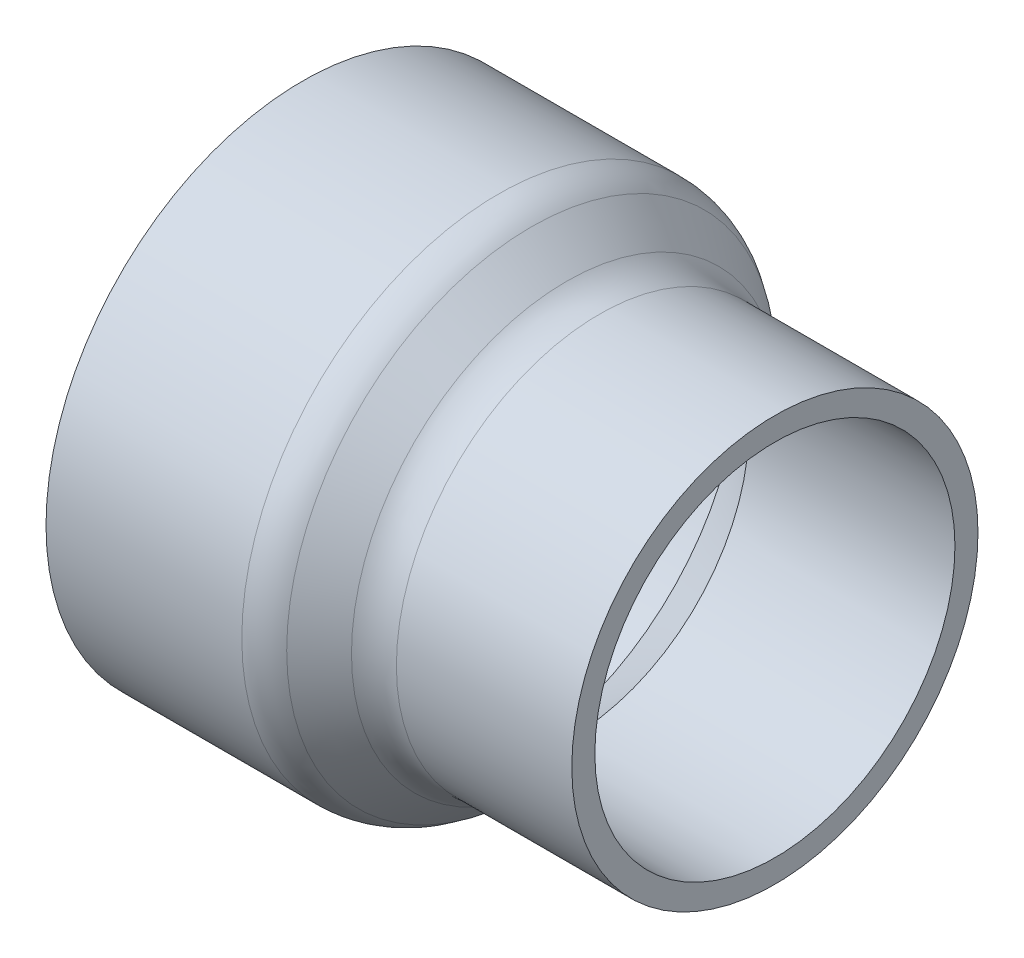
ISO-10303-21;
HEADER;
FILE_DESCRIPTION(('STEP AP214'),'2;1');
FILE_NAME('part.step','',(''),(''),'','','');
FILE_SCHEMA(('AUTOMOTIVE_DESIGN { 1 0 10303 214 1 1 1 1 }'));
ENDSEC;
DATA;
#1=APPLICATION_CONTEXT('core data for automotive mechanical design processes');
#2=APPLICATION_PROTOCOL_DEFINITION('international standard','automotive_design',2000,#1);
#3=PRODUCT_CONTEXT('',#1,'mechanical');
#4=PRODUCT('Part','Part','',(#3));
#5=PRODUCT_RELATED_PRODUCT_CATEGORY('part','',(#4));
#6=PRODUCT_DEFINITION_FORMATION('','',#4);
#7=PRODUCT_DEFINITION_CONTEXT('part definition',#1,'design');
#8=PRODUCT_DEFINITION('design','',#6,#7);
#9=PRODUCT_DEFINITION_SHAPE('','',#8);
#10=(LENGTH_UNIT() NAMED_UNIT(*) SI_UNIT(.MILLI.,.METRE.));
#11=(NAMED_UNIT(*) PLANE_ANGLE_UNIT() SI_UNIT($,.RADIAN.));
#12=(NAMED_UNIT(*) SI_UNIT($,.STERADIAN.) SOLID_ANGLE_UNIT());
#13=UNCERTAINTY_MEASURE_WITH_UNIT(LENGTH_MEASURE(1.E-05),#10,'distance_accuracy_value','');
#14=(GEOMETRIC_REPRESENTATION_CONTEXT(3) GLOBAL_UNCERTAINTY_ASSIGNED_CONTEXT((#13)) GLOBAL_UNIT_ASSIGNED_CONTEXT((#10,
#11,#12)) REPRESENTATION_CONTEXT('',''));
#15=CARTESIAN_POINT('',(0.,0.,0.));
#16=DIRECTION('',(0.,0.,1.));
#17=DIRECTION('',(1.,0.,0.));
#18=AXIS2_PLACEMENT_3D('',#15,#16,#17);
#19=CARTESIAN_POINT('',(-58.5597,0.,0.));
#20=DIRECTION('',(-1.,0.,0.));
#21=DIRECTION('',(0.,0.,1.));
#22=AXIS2_PLACEMENT_3D('',#19,#20,#21);
#23=CYLINDRICAL_SURFACE('',#22,63.6397);
#24=CARTESIAN_POINT('',(-10.0039202483172,0.,0.));
#25=DIRECTION('',(1.,0.,0.));
#26=DIRECTION('',(0.,0.,-1.));
#27=AXIS2_PLACEMENT_3D('',#24,#25,#26);
#28=CIRCLE('',#27,63.6397);
#29=CARTESIAN_POINT('',(-10.0039202483172,0.,-63.6397));
#30=VERTEX_POINT('',#29);
#31=EDGE_CURVE('E48',#30,#30,#28,.F.);
#32=ORIENTED_EDGE('',*,*,#31,.T.);
#33=EDGE_LOOP('',(#32));
#34=FACE_BOUND('',#33,.T.);
#35=CARTESIAN_POINT('',(-58.5597,0.,0.));
#36=DIRECTION('',(-1.,0.,0.));
#37=DIRECTION('',(0.,0.,1.));
#38=AXIS2_PLACEMENT_3D('',#35,#36,#37);
#39=CIRCLE('',#38,63.6397);
#40=CARTESIAN_POINT('',(-58.5597,0.,63.6397));
#41=VERTEX_POINT('',#40);
#42=EDGE_CURVE('E53',#41,#41,#39,.T.);
#43=ORIENTED_EDGE('',*,*,#42,.F.);
#44=EDGE_LOOP('',(#43));
#45=FACE_BOUND('',#44,.T.);
#46=ADVANCED_FACE('F33',(#34,#45),#23,.T.);
#47=CARTESIAN_POINT('',(-58.5597,-63.6397,0.));
#48=DIRECTION('',(-1.,0.,0.));
#49=DIRECTION('',(0.,0.,1.));
#50=AXIS2_PLACEMENT_3D('',#47,#48,#49);
#51=PLANE('',#50);
#52=ORIENTED_EDGE('',*,*,#42,.T.);
#53=EDGE_LOOP('',(#52));
#54=FACE_BOUND('',#53,.T.);
#55=CARTESIAN_POINT('',(-58.5597,0.,0.));
#56=DIRECTION('',(-1.,0.,0.));
#57=DIRECTION('',(0.,0.,1.));
#58=AXIS2_PLACEMENT_3D('',#55,#56,#57);
#59=CIRCLE('',#58,57.3786);
#60=CARTESIAN_POINT('',(-58.5597,0.,57.3786));
#61=VERTEX_POINT('',#60);
#62=EDGE_CURVE('E56',#61,#61,#59,.T.);
#63=ORIENTED_EDGE('',*,*,#62,.F.);
#64=EDGE_LOOP('',(#63));
#65=FACE_BOUND('',#64,.T.);
#66=ADVANCED_FACE('F92',(#54,#65),#51,.T.);
#67=CARTESIAN_POINT('',(-7.25169999999999,0.,0.));
#68=DIRECTION('',(-1.,0.,0.));
#69=DIRECTION('',(0.,0.,1.));
#70=AXIS2_PLACEMENT_3D('',#67,#68,#69);
#71=CONICAL_SURFACE('',#70,57.0357,0.00668306881884247);
#72=ORIENTED_EDGE('',*,*,#62,.T.);
#73=EDGE_LOOP('',(#72));
#74=FACE_BOUND('',#73,.T.);
#75=CARTESIAN_POINT('',(-7.25169999999999,0.,0.));
#76=DIRECTION('',(-1.,0.,0.));
#77=DIRECTION('',(0.,0.,1.));
#78=AXIS2_PLACEMENT_3D('',#75,#76,#77);
#79=CIRCLE('',#78,57.0357);
#80=CARTESIAN_POINT('',(-7.25169999999999,0.,57.0357));
#81=VERTEX_POINT('',#80);
#82=EDGE_CURVE('E59',#81,#81,#79,.T.);
#83=ORIENTED_EDGE('',*,*,#82,.F.);
#84=EDGE_LOOP('',(#83));
#85=FACE_BOUND('',#84,.T.);
#86=ADVANCED_FACE('F98',(#74,#85),#71,.F.);
#87=CARTESIAN_POINT('',(7.80462682951065,0.,0.));
#88=DIRECTION('',(-1.,0.,0.));
#89=DIRECTION('',(0.,0.,1.));
#90=AXIS2_PLACEMENT_3D('',#87,#88,#89);
#91=CONICAL_SURFACE('',#90,44.4019417104732,0.698131700797726);
#92=ORIENTED_EDGE('',*,*,#82,.T.);
#93=EDGE_LOOP('',(#92));
#94=FACE_BOUND('',#93,.T.);
#95=CARTESIAN_POINT('',(7.80462682951065,0.,0.));
#96=DIRECTION('',(-1.,0.,0.));
#97=DIRECTION('',(0.,0.,1.));
#98=AXIS2_PLACEMENT_3D('',#95,#96,#97);
#99=CIRCLE('',#98,44.4019417104732);
#100=CARTESIAN_POINT('',(7.80462682951065,0.,44.4019417104732));
#101=VERTEX_POINT('',#100);
#102=EDGE_CURVE('E62',#101,#101,#99,.T.);
#103=ORIENTED_EDGE('',*,*,#102,.F.);
#104=EDGE_LOOP('',(#103));
#105=FACE_BOUND('',#104,.T.);
#106=ADVANCED_FACE('F147',(#94,#105),#91,.F.);
#107=CARTESIAN_POINT('',(7.75969999999999,0.,0.));
#108=DIRECTION('',(1.,0.,0.));
#109=DIRECTION('',(0.,0.,-1.));
#110=AXIS2_PLACEMENT_3D('',#107,#108,#109);
#111=CONICAL_SURFACE('',#110,44.3484,0.872664625997104);
#112=ORIENTED_EDGE('',*,*,#102,.T.);
#113=EDGE_LOOP('',(#112));
#114=FACE_BOUND('',#113,.T.);
#115=CARTESIAN_POINT('',(7.75969999999999,0.,0.));
#116=DIRECTION('',(-1.,0.,0.));
#117=DIRECTION('',(0.,0.,1.));
#118=AXIS2_PLACEMENT_3D('',#115,#116,#117);
#119=CIRCLE('',#118,44.3484);
#120=CARTESIAN_POINT('',(7.75969999999999,0.,44.3484));
#121=VERTEX_POINT('',#120);
#122=EDGE_CURVE('E65',#121,#121,#119,.T.);
#123=ORIENTED_EDGE('',*,*,#122,.F.);
#124=EDGE_LOOP('',(#123));
#125=FACE_BOUND('',#124,.T.);
#126=ADVANCED_FACE('F88',(#114,#125),#111,.T.);
#127=CARTESIAN_POINT('',(58.5597,0.,0.));
#128=DIRECTION('',(1.,0.,0.));
#129=DIRECTION('',(0.,0.,-1.));
#130=AXIS2_PLACEMENT_3D('',#127,#128,#129);
#131=CONICAL_SURFACE('',#130,44.6532,0.00599992800155518);
#132=ORIENTED_EDGE('',*,*,#122,.T.);
#133=EDGE_LOOP('',(#132));
#134=FACE_BOUND('',#133,.T.);
#135=CARTESIAN_POINT('',(58.5597,0.,0.));
#136=DIRECTION('',(-1.,0.,0.));
#137=DIRECTION('',(0.,0.,1.));
#138=AXIS2_PLACEMENT_3D('',#135,#136,#137);
#139=CIRCLE('',#138,44.6532);
#140=CARTESIAN_POINT('',(58.5597,0.,44.6532));
#141=VERTEX_POINT('',#140);
#142=EDGE_CURVE('E68',#141,#141,#139,.T.);
#143=ORIENTED_EDGE('',*,*,#142,.F.);
#144=EDGE_LOOP('',(#143));
#145=FACE_BOUND('',#144,.T.);
#146=ADVANCED_FACE('F79',(#134,#145),#131,.F.);
#147=CARTESIAN_POINT('',(58.5597,-44.6532,0.));
#148=DIRECTION('',(1.,0.,0.));
#149=DIRECTION('',(0.,0.,-1.));
#150=AXIS2_PLACEMENT_3D('',#147,#148,#149);
#151=PLANE('',#150);
#152=ORIENTED_EDGE('',*,*,#142,.T.);
#153=EDGE_LOOP('',(#152));
#154=FACE_BOUND('',#153,.T.);
#155=CARTESIAN_POINT('',(58.5597,0.,0.));
#156=DIRECTION('',(-1.,0.,0.));
#157=DIRECTION('',(0.,0.,1.));
#158=AXIS2_PLACEMENT_3D('',#155,#156,#157);
#159=CIRCLE('',#158,50.3682);
#160=CARTESIAN_POINT('',(58.5597,0.,50.3682));
#161=VERTEX_POINT('',#160);
#162=EDGE_CURVE('E71',#161,#161,#159,.T.);
#163=ORIENTED_EDGE('',*,*,#162,.F.);
#164=EDGE_LOOP('',(#163));
#165=FACE_BOUND('',#164,.T.);
#166=ADVANCED_FACE('F77',(#154,#165),#151,.T.);
#167=CARTESIAN_POINT('',(-58.5597,0.,0.));
#168=DIRECTION('',(-1.,0.,0.));
#169=DIRECTION('',(0.,0.,1.));
#170=AXIS2_PLACEMENT_3D('',#167,#168,#169);
#171=CYLINDRICAL_SURFACE('',#170,50.3682);
#172=CARTESIAN_POINT('',(15.0572815061585,0.,0.));
#173=DIRECTION('',(-1.,0.,0.));
#174=DIRECTION('',(0.,0.,1.));
#175=AXIS2_PLACEMENT_3D('',#172,#173,#174);
#176=CIRCLE('',#175,50.3682);
#177=CARTESIAN_POINT('',(15.0572815061585,0.,50.3682));
#178=VERTEX_POINT('',#177);
#179=EDGE_CURVE('E10',#178,#178,#176,.F.);
#180=ORIENTED_EDGE('',*,*,#179,.T.);
#181=EDGE_LOOP('',(#180));
#182=FACE_BOUND('',#181,.T.);
#183=ORIENTED_EDGE('',*,*,#162,.T.);
#184=EDGE_LOOP('',(#183));
#185=FACE_BOUND('',#184,.T.);
#186=ADVANCED_FACE('F75',(#182,#185),#171,.T.);
#187=CARTESIAN_POINT('',(-5.38149827313646,0.,0.));
#188=DIRECTION('',(-1.,0.,0.));
#189=DIRECTION('',(0.,0.,1.));
#190=AXIS2_PLACEMENT_3D('',#187,#188,#189);
#191=CONICAL_SURFACE('',#190,63.6397,0.698131700797726);
#192=CARTESIAN_POINT('',(-1.8405176052982,0.,0.));
#193=DIRECTION('',(1.,0.,0.));
#194=DIRECTION('',(0.,0.,-1.));
#195=AXIS2_PLACEMENT_3D('',#192,#193,#194);
#196=CIRCLE('',#195,60.6684644276111);
#197=CARTESIAN_POINT('',(-1.8405176052982,0.,-60.6684644276111));
#198=VERTEX_POINT('',#197);
#199=EDGE_CURVE('E40',#198,#198,#196,.T.);
#200=ORIENTED_EDGE('',*,*,#199,.T.);
#201=EDGE_LOOP('',(#200));
#202=FACE_BOUND('',#201,.T.);
#203=CARTESIAN_POINT('',(6.89387886313952,0.,0.));
#204=DIRECTION('',(-1.,0.,0.));
#205=DIRECTION('',(0.,0.,1.));
#206=AXIS2_PLACEMENT_3D('',#203,#204,#205);
#207=CIRCLE('',#206,53.3394355723889);
#208=CARTESIAN_POINT('',(6.89387886313952,0.,53.3394355723889));
#209=VERTEX_POINT('',#208);
#210=EDGE_CURVE('E44',#209,#209,#207,.T.);
#211=ORIENTED_EDGE('',*,*,#210,.T.);
#212=EDGE_LOOP('',(#211));
#213=FACE_BOUND('',#212,.T.);
#214=ADVANCED_FACE('F86',(#202,#213),#191,.T.);
#215=CARTESIAN_POINT('',(-10.0039202483172,0.,0.));
#216=DIRECTION('',(1.,0.,0.));
#217=DIRECTION('',(0.,0.,-1.));
#218=AXIS2_PLACEMENT_3D('',#215,#216,#217);
#219=TOROIDAL_SURFACE('',#218,50.9397,12.7);
#220=ORIENTED_EDGE('',*,*,#199,.F.);
#221=EDGE_LOOP('',(#220));
#222=FACE_BOUND('',#221,.T.);
#223=ORIENTED_EDGE('',*,*,#31,.F.);
#224=EDGE_LOOP('',(#223));
#225=FACE_BOUND('',#224,.T.);
#226=ADVANCED_FACE('F103',(#222,#225),#219,.T.);
#227=CARTESIAN_POINT('',(15.0572815061585,0.,0.));
#228=DIRECTION('',(-1.,0.,0.));
#229=DIRECTION('',(0.,0.,1.));
#230=AXIS2_PLACEMENT_3D('',#227,#228,#229);
#231=TOROIDAL_SURFACE('',#230,63.0682,12.7);
#232=ORIENTED_EDGE('',*,*,#179,.F.);
#233=EDGE_LOOP('',(#232));
#234=FACE_BOUND('',#233,.T.);
#235=ORIENTED_EDGE('',*,*,#210,.F.);
#236=EDGE_LOOP('',(#235));
#237=FACE_BOUND('',#236,.T.);
#238=ADVANCED_FACE('F35',(#234,#237),#231,.F.);
#239=CLOSED_SHELL('',(#46,#66,#86,#106,#126,#146,#166,#186,#214,#226,#238));
#240=MANIFOLD_SOLID_BREP('B2',#239);
#241=ADVANCED_BREP_SHAPE_REPRESENTATION('',(#18,#240),#14);
#242=SHAPE_DEFINITION_REPRESENTATION(#9,#241);
ENDSEC;
END-ISO-10303-21;
